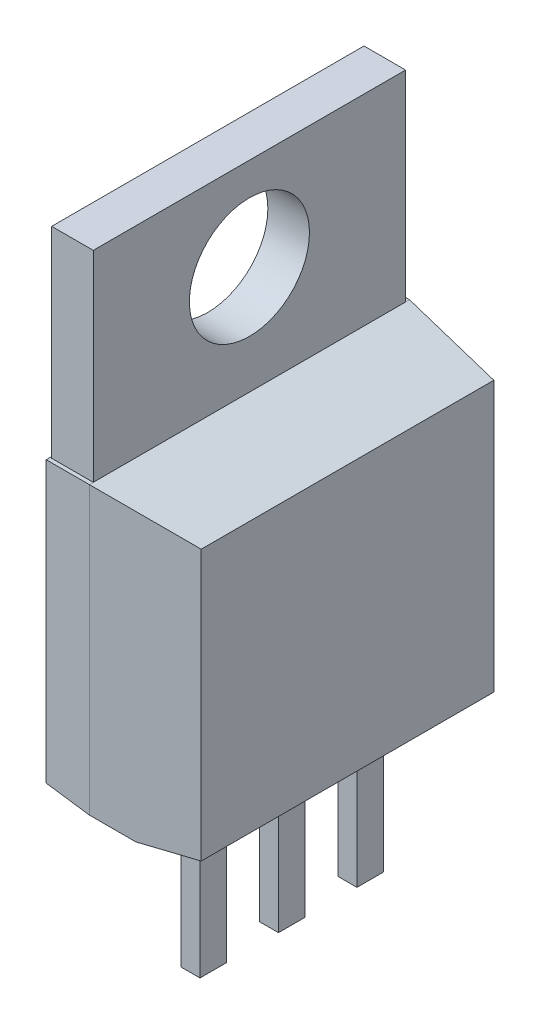
ISO-10303-21;
HEADER;
FILE_DESCRIPTION(('STEP AP214'),'2;1');
FILE_NAME('part.step','',(''),(''),'','','');
FILE_SCHEMA(('AUTOMOTIVE_DESIGN { 1 0 10303 214 1 1 1 1 }'));
ENDSEC;
DATA;
#1=APPLICATION_CONTEXT('core data for automotive mechanical design processes');
#2=APPLICATION_PROTOCOL_DEFINITION('international standard','automotive_design',2000,#1);
#3=PRODUCT_CONTEXT('',#1,'mechanical');
#4=PRODUCT('Part','Part','',(#3));
#5=PRODUCT_RELATED_PRODUCT_CATEGORY('part','',(#4));
#6=PRODUCT_DEFINITION_FORMATION('','',#4);
#7=PRODUCT_DEFINITION_CONTEXT('part definition',#1,'design');
#8=PRODUCT_DEFINITION('design','',#6,#7);
#9=PRODUCT_DEFINITION_SHAPE('','',#8);
#10=(LENGTH_UNIT() NAMED_UNIT(*) SI_UNIT(.MILLI.,.METRE.));
#11=(NAMED_UNIT(*) PLANE_ANGLE_UNIT() SI_UNIT($,.RADIAN.));
#12=(NAMED_UNIT(*) SI_UNIT($,.STERADIAN.) SOLID_ANGLE_UNIT());
#13=UNCERTAINTY_MEASURE_WITH_UNIT(LENGTH_MEASURE(1.E-05),#10,'distance_accuracy_value','');
#14=(GEOMETRIC_REPRESENTATION_CONTEXT(3) GLOBAL_UNCERTAINTY_ASSIGNED_CONTEXT((#13)) GLOBAL_UNIT_ASSIGNED_CONTEXT((#10,
#11,#12)) REPRESENTATION_CONTEXT('',''));
#15=CARTESIAN_POINT('',(0.,0.,0.));
#16=DIRECTION('',(0.,0.,1.));
#17=DIRECTION('',(1.,0.,0.));
#18=AXIS2_PLACEMENT_3D('',#15,#16,#17);
#19=CARTESIAN_POINT('',(-1.3208,0.,-5.1816));
#20=DIRECTION('',(-1.,0.,0.));
#21=DIRECTION('',(0.,0.,1.));
#22=AXIS2_PLACEMENT_3D('',#19,#20,#21);
#23=PLANE('',#22);
#24=DIRECTION('',(0.,0.,1.));
#25=VECTOR('',#24,1.);
#26=CARTESIAN_POINT('',(-1.3208,9.4488,-9.525));
#27=LINE('',#26,#25);
#28=CARTESIAN_POINT('',(-1.3208,9.4488,5.0546));
#29=VERTEX_POINT('',#28);
#30=CARTESIAN_POINT('',(-1.3208,9.4488,-5.0546));
#31=VERTEX_POINT('',#30);
#32=EDGE_CURVE('E301',#29,#31,#27,.F.);
#33=ORIENTED_EDGE('',*,*,#32,.T.);
#34=DIRECTION('',(0.,1.,0.));
#35=VECTOR('',#34,1.);
#36=CARTESIAN_POINT('',(-1.3208,16.5411947969702,-5.0546));
#37=LINE('',#36,#35);
#38=CARTESIAN_POINT('',(-1.3208,15.9512,-5.0546));
#39=VERTEX_POINT('',#38);
#40=EDGE_CURVE('E317',#31,#39,#37,.T.);
#41=ORIENTED_EDGE('',*,*,#40,.T.);
#42=DIRECTION('',(0.,0.,1.));
#43=VECTOR('',#42,1.);
#44=CARTESIAN_POINT('',(-1.3208,15.9512,5.1816));
#45=LINE('',#44,#43);
#46=CARTESIAN_POINT('',(-1.3208,15.9512,5.0546));
#47=VERTEX_POINT('',#46);
#48=EDGE_CURVE('E311',#47,#39,#45,.F.);
#49=ORIENTED_EDGE('',*,*,#48,.F.);
#50=DIRECTION('',(0.,1.,0.));
#51=VECTOR('',#50,1.);
#52=CARTESIAN_POINT('',(-1.3208,9.4488,5.0546));
#53=LINE('',#52,#51);
#54=EDGE_CURVE('E304',#47,#29,#53,.F.);
#55=ORIENTED_EDGE('',*,*,#54,.T.);
#56=EDGE_LOOP('',(#33,#41,#49,#55));
#57=FACE_BOUND('',#56,.T.);
#58=CARTESIAN_POINT('',(-1.3208,12.954,0.));
#59=DIRECTION('',(1.,0.,0.));
#60=DIRECTION('',(0.,0.,-1.));
#61=AXIS2_PLACEMENT_3D('',#58,#59,#60);
#62=CIRCLE('',#61,1.9431);
#63=CARTESIAN_POINT('',(-1.3208,12.954,-1.9431));
#64=VERTEX_POINT('',#63);
#65=EDGE_CURVE('E19',#64,#64,#62,.F.);
#66=ORIENTED_EDGE('',*,*,#65,.T.);
#67=EDGE_LOOP('',(#66));
#68=FACE_BOUND('',#67,.T.);
#69=ADVANCED_FACE('F16',(#57,#68),#23,.F.);
#70=CARTESIAN_POINT('',(0.0508,4.9022,-2.9718));
#71=DIRECTION('',(0.,0.,-1.));
#72=DIRECTION('',(-1.,0.,0.));
#73=AXIS2_PLACEMENT_3D('',#70,#71,#72);
#74=PLANE('',#73);
#75=DIRECTION('',(0.,1.,0.));
#76=VECTOR('',#75,1.);
#77=CARTESIAN_POINT('',(0.0508,4.9022,-2.9718));
#78=LINE('',#77,#76);
#79=CARTESIAN_POINT('',(0.0508,-4.8006,-2.9718));
#80=VERTEX_POINT('',#79);
#81=CARTESIAN_POINT('',(0.0507999999999999,0.00713947440288239,-2.9718));
#82=VERTEX_POINT('',#81);
#83=EDGE_CURVE('E287',#80,#82,#78,.T.);
#84=ORIENTED_EDGE('',*,*,#83,.F.);
#85=DIRECTION('',(1.,0.,0.));
#86=VECTOR('',#85,1.);
#87=CARTESIAN_POINT('',(0.,-4.8006,-2.9718));
#88=LINE('',#87,#86);
#89=CARTESIAN_POINT('',(-0.5588,-4.8006,-2.9718));
#90=VERTEX_POINT('',#89);
#91=EDGE_CURVE('E289',#80,#90,#88,.F.);
#92=ORIENTED_EDGE('',*,*,#91,.T.);
#93=DIRECTION('',(0.,1.,0.));
#94=VECTOR('',#93,1.);
#95=CARTESIAN_POINT('',(-0.5588,4.9022,-2.9718));
#96=LINE('',#95,#94);
#97=CARTESIAN_POINT('',(-0.5588,0.0785342184317104,-2.9718));
#98=VERTEX_POINT('',#97);
#99=EDGE_CURVE('E214',#98,#90,#96,.F.);
#100=ORIENTED_EDGE('',*,*,#99,.F.);
#101=DIRECTION('',(0.990268068741568,-0.139173100960085,0.));
#102=VECTOR('',#101,1.);
#103=CARTESIAN_POINT('',(-0.5588,0.0785342184317075,-2.9718));
#104=LINE('',#103,#102);
#105=CARTESIAN_POINT('',(0.,0.,-2.9718));
#106=VERTEX_POINT('',#105);
#107=EDGE_CURVE('E203',#98,#106,#104,.T.);
#108=ORIENTED_EDGE('',*,*,#107,.T.);
#109=DIRECTION('',(0.990268068741569,0.139173100960077,0.));
#110=VECTOR('',#109,1.);
#111=CARTESIAN_POINT('',(0.,0.,-2.9718));
#112=LINE('',#111,#110);
#113=EDGE_CURVE('E192',#106,#82,#112,.T.);
#114=ORIENTED_EDGE('',*,*,#113,.T.);
#115=EDGE_LOOP('',(#84,#92,#100,#108,#114));
#116=FACE_BOUND('',#115,.T.);
#117=ADVANCED_FACE('F212',(#116),#74,.T.);
#118=CARTESIAN_POINT('',(0.0508,4.9022,0.4318));
#119=DIRECTION('',(1.,0.,0.));
#120=DIRECTION('',(0.,0.,-1.));
#121=AXIS2_PLACEMENT_3D('',#118,#119,#120);
#122=PLANE('',#121);
#123=DIRECTION('',(0.,1.,0.));
#124=VECTOR('',#123,1.);
#125=CARTESIAN_POINT('',(0.0508,4.9022,0.4318));
#126=LINE('',#125,#124);
#127=CARTESIAN_POINT('',(0.0508,-4.8006,0.4318));
#128=VERTEX_POINT('',#127);
#129=CARTESIAN_POINT('',(0.0507999999999999,0.00713947440288261,0.4318));
#130=VERTEX_POINT('',#129);
#131=EDGE_CURVE('E275',#128,#130,#126,.T.);
#132=ORIENTED_EDGE('',*,*,#131,.F.);
#133=DIRECTION('',(0.,0.,-1.));
#134=VECTOR('',#133,1.);
#135=CARTESIAN_POINT('',(0.0508,-4.8006,0.4318));
#136=LINE('',#135,#134);
#137=CARTESIAN_POINT('',(0.0508,-4.8006,-0.4318));
#138=VERTEX_POINT('',#137);
#139=EDGE_CURVE('E325',#128,#138,#136,.T.);
#140=ORIENTED_EDGE('',*,*,#139,.T.);
#141=DIRECTION('',(0.,1.,0.));
#142=VECTOR('',#141,1.);
#143=CARTESIAN_POINT('',(0.0507999999999999,4.9022,-0.4318));
#144=LINE('',#143,#142);
#145=CARTESIAN_POINT('',(0.0507999999999999,0.0071394744028826,-0.4318));
#146=VERTEX_POINT('',#145);
#147=EDGE_CURVE('E266',#146,#138,#144,.F.);
#148=ORIENTED_EDGE('',*,*,#147,.F.);
#149=DIRECTION('',(0.,0.,-1.));
#150=VECTOR('',#149,1.);
#151=CARTESIAN_POINT('',(0.0508,0.00713947440288219,0.4318));
#152=LINE('',#151,#150);
#153=EDGE_CURVE('E202',#146,#130,#152,.F.);
#154=ORIENTED_EDGE('',*,*,#153,.T.);
#155=EDGE_LOOP('',(#132,#140,#148,#154));
#156=FACE_BOUND('',#155,.T.);
#157=ADVANCED_FACE('F330',(#156),#122,.T.);
#158=CARTESIAN_POINT('',(0.0508,4.9022,2.9718));
#159=DIRECTION('',(1.,0.,0.));
#160=DIRECTION('',(0.,0.,-1.));
#161=AXIS2_PLACEMENT_3D('',#158,#159,#160);
#162=PLANE('',#161);
#163=DIRECTION('',(0.,1.,0.));
#164=VECTOR('',#163,1.);
#165=CARTESIAN_POINT('',(0.0508,4.9022,2.9718));
#166=LINE('',#165,#164);
#167=CARTESIAN_POINT('',(0.0508,-4.8006,2.9718));
#168=VERTEX_POINT('',#167);
#169=CARTESIAN_POINT('',(0.0507999999999999,0.00713947440288261,2.9718));
#170=VERTEX_POINT('',#169);
#171=EDGE_CURVE('E253',#168,#170,#166,.T.);
#172=ORIENTED_EDGE('',*,*,#171,.F.);
#173=DIRECTION('',(0.,0.,-1.));
#174=VECTOR('',#173,1.);
#175=CARTESIAN_POINT('',(0.0508,-4.8006,2.9718));
#176=LINE('',#175,#174);
#177=CARTESIAN_POINT('',(0.0508,-4.8006,2.1082));
#178=VERTEX_POINT('',#177);
#179=EDGE_CURVE('E320',#168,#178,#176,.T.);
#180=ORIENTED_EDGE('',*,*,#179,.T.);
#181=DIRECTION('',(0.,1.,0.));
#182=VECTOR('',#181,1.);
#183=CARTESIAN_POINT('',(0.0507999999999999,4.9022,2.1082));
#184=LINE('',#183,#182);
#185=CARTESIAN_POINT('',(0.0507999999999999,0.0071394744028826,2.1082));
#186=VERTEX_POINT('',#185);
#187=EDGE_CURVE('E244',#186,#178,#184,.F.);
#188=ORIENTED_EDGE('',*,*,#187,.F.);
#189=DIRECTION('',(0.,0.,-1.));
#190=VECTOR('',#189,1.);
#191=CARTESIAN_POINT('',(0.0508,0.00713947440288219,2.9718));
#192=LINE('',#191,#190);
#193=EDGE_CURVE('E322',#186,#170,#192,.F.);
#194=ORIENTED_EDGE('',*,*,#193,.T.);
#195=EDGE_LOOP('',(#172,#180,#188,#194));
#196=FACE_BOUND('',#195,.T.);
#197=ADVANCED_FACE('F554',(#196),#162,.T.);
#198=CARTESIAN_POINT('',(-1.3208,12.954,0.));
#199=DIRECTION('',(1.,0.,0.));
#200=DIRECTION('',(0.,0.,-1.));
#201=AXIS2_PLACEMENT_3D('',#198,#199,#200);
#202=CYLINDRICAL_SURFACE('',#201,1.9431);
#203=ORIENTED_EDGE('',*,*,#65,.F.);
#204=EDGE_LOOP('',(#203));
#205=FACE_BOUND('',#204,.T.);
#206=CARTESIAN_POINT('',(-2.667,12.954,0.));
#207=DIRECTION('',(1.,0.,0.));
#208=DIRECTION('',(0.,0.,-1.));
#209=AXIS2_PLACEMENT_3D('',#206,#207,#208);
#210=CIRCLE('',#209,1.9431);
#211=CARTESIAN_POINT('',(-2.667,12.954,-1.9431));
#212=VERTEX_POINT('',#211);
#213=EDGE_CURVE('E218',#212,#212,#210,.F.);
#214=ORIENTED_EDGE('',*,*,#213,.T.);
#215=EDGE_LOOP('',(#214));
#216=FACE_BOUND('',#215,.T.);
#217=ADVANCED_FACE('F550',(#205,#216),#202,.F.);
#218=CARTESIAN_POINT('',(-1.3208,16.5411947969702,-5.0546));
#219=DIRECTION('',(0.,0.,1.));
#220=DIRECTION('',(1.,0.,0.));
#221=AXIS2_PLACEMENT_3D('',#218,#219,#220);
#222=PLANE('',#221);
#223=DIRECTION('',(1.,0.,0.));
#224=VECTOR('',#223,1.);
#225=CARTESIAN_POINT('',(-1.3208,9.4488,-5.0546));
#226=LINE('',#225,#224);
#227=CARTESIAN_POINT('',(-2.667,9.4488,-5.0546));
#228=VERTEX_POINT('',#227);
#229=EDGE_CURVE('E186',#228,#31,#226,.T.);
#230=ORIENTED_EDGE('',*,*,#229,.F.);
#231=DIRECTION('',(0.,1.,0.));
#232=VECTOR('',#231,1.);
#233=CARTESIAN_POINT('',(-2.667,9.4488,-5.0546));
#234=LINE('',#233,#232);
#235=CARTESIAN_POINT('',(-2.667,15.9512,-5.0546));
#236=VERTEX_POINT('',#235);
#237=EDGE_CURVE('E220',#228,#236,#234,.T.);
#238=ORIENTED_EDGE('',*,*,#237,.T.);
#239=DIRECTION('',(1.,0.,0.));
#240=VECTOR('',#239,1.);
#241=CARTESIAN_POINT('',(-2.7178,15.9512,-5.0546));
#242=LINE('',#241,#240);
#243=EDGE_CURVE('E314',#39,#236,#242,.F.);
#244=ORIENTED_EDGE('',*,*,#243,.F.);
#245=ORIENTED_EDGE('',*,*,#40,.F.);
#246=EDGE_LOOP('',(#230,#238,#244,#245));
#247=FACE_BOUND('',#246,.T.);
#248=ADVANCED_FACE('F547',(#247),#222,.F.);
#249=CARTESIAN_POINT('',(-2.7178,15.9512,5.1816));
#250=DIRECTION('',(0.,1.,0.));
#251=DIRECTION('',(0.,0.,1.));
#252=AXIS2_PLACEMENT_3D('',#249,#250,#251);
#253=PLANE('',#252);
#254=DIRECTION('',(-1.,0.,0.));
#255=VECTOR('',#254,1.);
#256=CARTESIAN_POINT('',(-1.3208,15.9512,5.0546));
#257=LINE('',#256,#255);
#258=CARTESIAN_POINT('',(-2.667,15.9512,5.0546));
#259=VERTEX_POINT('',#258);
#260=EDGE_CURVE('E306',#259,#47,#257,.F.);
#261=ORIENTED_EDGE('',*,*,#260,.T.);
#262=ORIENTED_EDGE('',*,*,#48,.T.);
#263=ORIENTED_EDGE('',*,*,#243,.T.);
#264=DIRECTION('',(0.,0.,-1.));
#265=VECTOR('',#264,1.);
#266=CARTESIAN_POINT('',(-2.667,15.9512,-6.35));
#267=LINE('',#266,#265);
#268=EDGE_CURVE('E224',#236,#259,#267,.F.);
#269=ORIENTED_EDGE('',*,*,#268,.T.);
#270=EDGE_LOOP('',(#261,#262,#263,#269));
#271=FACE_BOUND('',#270,.T.);
#272=ADVANCED_FACE('F379',(#271),#253,.T.);
#273=CARTESIAN_POINT('',(-1.3208,9.4488,5.0546));
#274=DIRECTION('',(0.,0.,-1.));
#275=DIRECTION('',(-1.,0.,0.));
#276=AXIS2_PLACEMENT_3D('',#273,#274,#275);
#277=PLANE('',#276);
#278=ORIENTED_EDGE('',*,*,#260,.F.);
#279=DIRECTION('',(0.,1.,0.));
#280=VECTOR('',#279,1.);
#281=CARTESIAN_POINT('',(-2.667,9.4488,5.0546));
#282=LINE('',#281,#280);
#283=CARTESIAN_POINT('',(-2.667,9.4488,5.0546));
#284=VERTEX_POINT('',#283);
#285=EDGE_CURVE('E374',#259,#284,#282,.F.);
#286=ORIENTED_EDGE('',*,*,#285,.T.);
#287=DIRECTION('',(-1.,0.,0.));
#288=VECTOR('',#287,1.);
#289=CARTESIAN_POINT('',(-1.3208,9.4488,5.0546));
#290=LINE('',#289,#288);
#291=EDGE_CURVE('E309',#29,#284,#290,.T.);
#292=ORIENTED_EDGE('',*,*,#291,.F.);
#293=ORIENTED_EDGE('',*,*,#54,.F.);
#294=EDGE_LOOP('',(#278,#286,#292,#293));
#295=FACE_BOUND('',#294,.T.);
#296=ADVANCED_FACE('F386',(#295),#277,.F.);
#297=CARTESIAN_POINT('',(-1.3208,9.4488,-9.525));
#298=DIRECTION('',(-0.139173100960095,-0.990268068741566,0.));
#299=DIRECTION('',(0.990268068741566,-0.139173100960095,0.));
#300=AXIS2_PLACEMENT_3D('',#297,#298,#299);
#301=PLANE('',#300);
#302=DIRECTION('',(0.980814848463982,-0.137844537491648,-0.137844537491658));
#303=VECTOR('',#302,1.);
#304=CARTESIAN_POINT('',(-1.32080000000016,9.4488,5.18159999999889));
#305=LINE('',#304,#303);
#306=CARTESIAN_POINT('',(-1.32080000000006,9.4488,5.18159999999955));
#307=VERTEX_POINT('',#306);
#308=CARTESIAN_POINT('',(1.85419999999995,9.00258284981983,4.73538284981936));
#309=VERTEX_POINT('',#308);
#310=EDGE_CURVE('E231',#307,#309,#305,.T.);
#311=ORIENTED_EDGE('',*,*,#310,.T.);
#312=DIRECTION('',(0.,0.,-1.));
#313=VECTOR('',#312,1.);
#314=CARTESIAN_POINT('',(1.8542,9.00258284981985,-5.1816));
#315=LINE('',#314,#313);
#316=CARTESIAN_POINT('',(1.85419999999999,9.00258284981984,-4.73538284981984));
#317=VERTEX_POINT('',#316);
#318=EDGE_CURVE('E236',#317,#309,#315,.F.);
#319=ORIENTED_EDGE('',*,*,#318,.F.);
#320=DIRECTION('',(-0.980814848463982,0.137844537491648,-0.137844537491658));
#321=VECTOR('',#320,1.);
#322=CARTESIAN_POINT('',(1.85419999999999,9.00258284981985,-4.73538284981981));
#323=LINE('',#322,#321);
#324=CARTESIAN_POINT('',(-1.3208,9.4488,-5.1816));
#325=VERTEX_POINT('',#324);
#326=EDGE_CURVE('E368',#317,#325,#323,.T.);
#327=ORIENTED_EDGE('',*,*,#326,.T.);
#328=DIRECTION('',(0.,0.,1.));
#329=VECTOR('',#328,1.);
#330=CARTESIAN_POINT('',(-1.3208,9.4488,-9.525));
#331=LINE('',#330,#329);
#332=EDGE_CURVE('E299',#31,#325,#331,.F.);
#333=ORIENTED_EDGE('',*,*,#332,.F.);
#334=ORIENTED_EDGE('',*,*,#32,.F.);
#335=DIRECTION('',(0.,0.,1.));
#336=VECTOR('',#335,1.);
#337=CARTESIAN_POINT('',(-1.32080000000004,9.44880000000001,-9.525));
#338=LINE('',#337,#336);
#339=EDGE_CURVE('E296',#307,#29,#338,.F.);
#340=ORIENTED_EDGE('',*,*,#339,.F.);
#341=EDGE_LOOP('',(#311,#319,#327,#333,#334,#340));
#342=FACE_BOUND('',#341,.T.);
#343=ADVANCED_FACE('F465',(#342),#301,.F.);
#344=CARTESIAN_POINT('',(-0.5588,4.9022,-2.9718));
#345=DIRECTION('',(-1.,0.,0.));
#346=DIRECTION('',(0.,0.,1.));
#347=AXIS2_PLACEMENT_3D('',#344,#345,#346);
#348=PLANE('',#347);
#349=ORIENTED_EDGE('',*,*,#99,.T.);
#350=DIRECTION('',(0.,0.,1.));
#351=VECTOR('',#350,1.);
#352=CARTESIAN_POINT('',(-0.5588,-4.8006,0.));
#353=LINE('',#352,#351);
#354=CARTESIAN_POINT('',(-0.5588,-4.8006,-2.1082));
#355=VERTEX_POINT('',#354);
#356=EDGE_CURVE('E291',#90,#355,#353,.T.);
#357=ORIENTED_EDGE('',*,*,#356,.T.);
#358=DIRECTION('',(0.,1.,0.));
#359=VECTOR('',#358,1.);
#360=CARTESIAN_POINT('',(-0.5588,4.9022,-2.1082));
#361=LINE('',#360,#359);
#362=CARTESIAN_POINT('',(-0.5588,0.078534218431709,-2.1082));
#363=VERTEX_POINT('',#362);
#364=EDGE_CURVE('E364',#363,#355,#361,.F.);
#365=ORIENTED_EDGE('',*,*,#364,.F.);
#366=DIRECTION('',(0.,0.,1.));
#367=VECTOR('',#366,1.);
#368=CARTESIAN_POINT('',(-0.5588,0.0785342184317075,-2.9718));
#369=LINE('',#368,#367);
#370=EDGE_CURVE('E294',#363,#98,#369,.F.);
#371=ORIENTED_EDGE('',*,*,#370,.T.);
#372=EDGE_LOOP('',(#349,#357,#365,#371));
#373=FACE_BOUND('',#372,.T.);
#374=ADVANCED_FACE('F536',(#373),#348,.T.);
#375=CARTESIAN_POINT('',(0.,-4.8006,0.));
#376=DIRECTION('',(0.,1.,0.));
#377=DIRECTION('',(0.,0.,1.));
#378=AXIS2_PLACEMENT_3D('',#375,#376,#377);
#379=PLANE('',#378);
#380=DIRECTION('',(0.,0.,-1.));
#381=VECTOR('',#380,1.);
#382=CARTESIAN_POINT('',(0.0508,-4.8006,-2.1082));
#383=LINE('',#382,#381);
#384=CARTESIAN_POINT('',(0.0508,-4.8006,-2.1082));
#385=VERTEX_POINT('',#384);
#386=EDGE_CURVE('E283',#385,#80,#383,.T.);
#387=ORIENTED_EDGE('',*,*,#386,.F.);
#388=DIRECTION('',(1.,0.,0.));
#389=VECTOR('',#388,1.);
#390=CARTESIAN_POINT('',(-0.5588,-4.8006,-2.1082));
#391=LINE('',#390,#389);
#392=EDGE_CURVE('E361',#355,#385,#391,.T.);
#393=ORIENTED_EDGE('',*,*,#392,.F.);
#394=ORIENTED_EDGE('',*,*,#356,.F.);
#395=ORIENTED_EDGE('',*,*,#91,.F.);
#396=EDGE_LOOP('',(#387,#393,#394,#395));
#397=FACE_BOUND('',#396,.T.);
#398=ADVANCED_FACE('F532',(#397),#379,.F.);
#399=CARTESIAN_POINT('',(0.0508,4.9022,-2.1082));
#400=DIRECTION('',(1.,0.,0.));
#401=DIRECTION('',(0.,0.,-1.));
#402=AXIS2_PLACEMENT_3D('',#399,#400,#401);
#403=PLANE('',#402);
#404=DIRECTION('',(0.,1.,0.));
#405=VECTOR('',#404,1.);
#406=CARTESIAN_POINT('',(0.0508,4.9022,-2.1082));
#407=LINE('',#406,#405);
#408=CARTESIAN_POINT('',(0.0508,0.0071394744028824,-2.1082));
#409=VERTEX_POINT('',#408);
#410=EDGE_CURVE('E358',#385,#409,#407,.T.);
#411=ORIENTED_EDGE('',*,*,#410,.F.);
#412=ORIENTED_EDGE('',*,*,#386,.T.);
#413=ORIENTED_EDGE('',*,*,#83,.T.);
#414=DIRECTION('',(0.,0.,-1.));
#415=VECTOR('',#414,1.);
#416=CARTESIAN_POINT('',(0.0508,0.00713947440288219,-2.1082));
#417=LINE('',#416,#415);
#418=EDGE_CURVE('E198',#82,#409,#417,.F.);
#419=ORIENTED_EDGE('',*,*,#418,.T.);
#420=EDGE_LOOP('',(#411,#412,#413,#419));
#421=FACE_BOUND('',#420,.T.);
#422=ADVANCED_FACE('F529',(#421),#403,.T.);
#423=CARTESIAN_POINT('',(-0.5588,4.9022,0.4318));
#424=DIRECTION('',(0.,0.,1.));
#425=DIRECTION('',(1.,0.,0.));
#426=AXIS2_PLACEMENT_3D('',#423,#424,#425);
#427=PLANE('',#426);
#428=DIRECTION('',(1.,0.,0.));
#429=VECTOR('',#428,1.);
#430=CARTESIAN_POINT('',(0.,-4.8006,0.4318));
#431=LINE('',#430,#429);
#432=CARTESIAN_POINT('',(-0.5588,-4.8006,0.4318));
#433=VERTEX_POINT('',#432);
#434=EDGE_CURVE('E261',#433,#128,#431,.T.);
#435=ORIENTED_EDGE('',*,*,#434,.T.);
#436=ORIENTED_EDGE('',*,*,#131,.T.);
#437=DIRECTION('',(-0.990268068741568,-0.139173100960079,0.));
#438=VECTOR('',#437,1.);
#439=CARTESIAN_POINT('',(0.0507999999999999,0.00713947440288219,0.4318));
#440=LINE('',#439,#438);
#441=CARTESIAN_POINT('',(0.,0.,0.4318));
#442=VERTEX_POINT('',#441);
#443=EDGE_CURVE('E280',#130,#442,#440,.T.);
#444=ORIENTED_EDGE('',*,*,#443,.T.);
#445=DIRECTION('',(-0.990268068741568,0.139173100960085,0.));
#446=VECTOR('',#445,1.);
#447=CARTESIAN_POINT('',(0.,0.,0.4318));
#448=LINE('',#447,#446);
#449=CARTESIAN_POINT('',(-0.5588,0.078534218431709,0.4318));
#450=VERTEX_POINT('',#449);
#451=EDGE_CURVE('E278',#442,#450,#448,.T.);
#452=ORIENTED_EDGE('',*,*,#451,.T.);
#453=DIRECTION('',(0.,1.,0.));
#454=VECTOR('',#453,1.);
#455=CARTESIAN_POINT('',(-0.5588,4.9022,0.4318));
#456=LINE('',#455,#454);
#457=EDGE_CURVE('E335',#433,#450,#456,.T.);
#458=ORIENTED_EDGE('',*,*,#457,.F.);
#459=EDGE_LOOP('',(#435,#436,#444,#452,#458));
#460=FACE_BOUND('',#459,.T.);
#461=ADVANCED_FACE('F332',(#460),#427,.T.);
#462=CARTESIAN_POINT('',(0.0508,4.9022,-0.4318));
#463=DIRECTION('',(0.,0.,-1.));
#464=DIRECTION('',(-1.,0.,0.));
#465=AXIS2_PLACEMENT_3D('',#462,#463,#464);
#466=PLANE('',#465);
#467=ORIENTED_EDGE('',*,*,#147,.T.);
#468=DIRECTION('',(1.,0.,0.));
#469=VECTOR('',#468,1.);
#470=CARTESIAN_POINT('',(0.,-4.8006,-0.4318));
#471=LINE('',#470,#469);
#472=CARTESIAN_POINT('',(-0.5588,-4.8006,-0.4318));
#473=VERTEX_POINT('',#472);
#474=EDGE_CURVE('E264',#138,#473,#471,.F.);
#475=ORIENTED_EDGE('',*,*,#474,.T.);
#476=DIRECTION('',(0.,1.,0.));
#477=VECTOR('',#476,1.);
#478=CARTESIAN_POINT('',(-0.5588,4.9022,-0.4318));
#479=LINE('',#478,#477);
#480=CARTESIAN_POINT('',(-0.5588,0.078534218431709,-0.4318));
#481=VERTEX_POINT('',#480);
#482=EDGE_CURVE('E348',#481,#473,#479,.F.);
#483=ORIENTED_EDGE('',*,*,#482,.F.);
#484=DIRECTION('',(0.990268068741568,-0.139173100960085,0.));
#485=VECTOR('',#484,1.);
#486=CARTESIAN_POINT('',(-0.5588,0.0785342184317075,-0.4318));
#487=LINE('',#486,#485);
#488=CARTESIAN_POINT('',(0.,0.,-0.4318));
#489=VERTEX_POINT('',#488);
#490=EDGE_CURVE('E272',#481,#489,#487,.T.);
#491=ORIENTED_EDGE('',*,*,#490,.T.);
#492=DIRECTION('',(0.990268068741569,0.139173100960077,0.));
#493=VECTOR('',#492,1.);
#494=CARTESIAN_POINT('',(0.,0.,-0.4318));
#495=LINE('',#494,#493);
#496=EDGE_CURVE('E269',#489,#146,#495,.T.);
#497=ORIENTED_EDGE('',*,*,#496,.T.);
#498=EDGE_LOOP('',(#467,#475,#483,#491,#497));
#499=FACE_BOUND('',#498,.T.);
#500=ADVANCED_FACE('F523',(#499),#466,.T.);
#501=CARTESIAN_POINT('',(0.,-4.8006,0.));
#502=DIRECTION('',(0.,1.,0.));
#503=DIRECTION('',(0.,0.,1.));
#504=AXIS2_PLACEMENT_3D('',#501,#502,#503);
#505=PLANE('',#504);
#506=ORIENTED_EDGE('',*,*,#434,.F.);
#507=DIRECTION('',(0.,0.,1.));
#508=VECTOR('',#507,1.);
#509=CARTESIAN_POINT('',(-0.5588,-4.8006,-0.4318));
#510=LINE('',#509,#508);
#511=EDGE_CURVE('E341',#473,#433,#510,.T.);
#512=ORIENTED_EDGE('',*,*,#511,.F.);
#513=ORIENTED_EDGE('',*,*,#474,.F.);
#514=ORIENTED_EDGE('',*,*,#139,.F.);
#515=EDGE_LOOP('',(#506,#512,#513,#514));
#516=FACE_BOUND('',#515,.T.);
#517=ADVANCED_FACE('F339',(#516),#505,.F.);
#518=CARTESIAN_POINT('',(-0.5588,4.9022,2.9718));
#519=DIRECTION('',(0.,0.,1.));
#520=DIRECTION('',(1.,0.,0.));
#521=AXIS2_PLACEMENT_3D('',#518,#519,#520);
#522=PLANE('',#521);
#523=DIRECTION('',(1.,0.,0.));
#524=VECTOR('',#523,1.);
#525=CARTESIAN_POINT('',(0.,-4.8006,2.9718));
#526=LINE('',#525,#524);
#527=CARTESIAN_POINT('',(-0.5588,-4.8006,2.9718));
#528=VERTEX_POINT('',#527);
#529=EDGE_CURVE('E239',#528,#168,#526,.T.);
#530=ORIENTED_EDGE('',*,*,#529,.T.);
#531=ORIENTED_EDGE('',*,*,#171,.T.);
#532=DIRECTION('',(-0.990268068741568,-0.139173100960079,0.));
#533=VECTOR('',#532,1.);
#534=CARTESIAN_POINT('',(0.0507999999999999,0.00713947440288219,2.9718));
#535=LINE('',#534,#533);
#536=CARTESIAN_POINT('',(0.,0.,2.9718));
#537=VERTEX_POINT('',#536);
#538=EDGE_CURVE('E258',#170,#537,#535,.T.);
#539=ORIENTED_EDGE('',*,*,#538,.T.);
#540=DIRECTION('',(-0.990268068741568,0.139173100960085,0.));
#541=VECTOR('',#540,1.);
#542=CARTESIAN_POINT('',(0.,0.,2.9718));
#543=LINE('',#542,#541);
#544=CARTESIAN_POINT('',(-0.5588,0.078534218431709,2.9718));
#545=VERTEX_POINT('',#544);
#546=EDGE_CURVE('E256',#537,#545,#543,.T.);
#547=ORIENTED_EDGE('',*,*,#546,.T.);
#548=DIRECTION('',(0.,1.,0.));
#549=VECTOR('',#548,1.);
#550=CARTESIAN_POINT('',(-0.5588,4.9022,2.9718));
#551=LINE('',#550,#549);
#552=EDGE_CURVE('E349',#528,#545,#551,.T.);
#553=ORIENTED_EDGE('',*,*,#552,.F.);
#554=EDGE_LOOP('',(#530,#531,#539,#547,#553));
#555=FACE_BOUND('',#554,.T.);
#556=ADVANCED_FACE('F430',(#555),#522,.T.);
#557=CARTESIAN_POINT('',(0.0508,4.9022,2.1082));
#558=DIRECTION('',(0.,0.,-1.));
#559=DIRECTION('',(-1.,0.,0.));
#560=AXIS2_PLACEMENT_3D('',#557,#558,#559);
#561=PLANE('',#560);
#562=ORIENTED_EDGE('',*,*,#187,.T.);
#563=DIRECTION('',(1.,0.,0.));
#564=VECTOR('',#563,1.);
#565=CARTESIAN_POINT('',(0.,-4.8006,2.1082));
#566=LINE('',#565,#564);
#567=CARTESIAN_POINT('',(-0.5588,-4.8006,2.1082));
#568=VERTEX_POINT('',#567);
#569=EDGE_CURVE('E242',#178,#568,#566,.F.);
#570=ORIENTED_EDGE('',*,*,#569,.T.);
#571=DIRECTION('',(0.,1.,0.));
#572=VECTOR('',#571,1.);
#573=CARTESIAN_POINT('',(-0.5588,4.9022,2.1082));
#574=LINE('',#573,#572);
#575=CARTESIAN_POINT('',(-0.5588,0.078534218431709,2.1082));
#576=VERTEX_POINT('',#575);
#577=EDGE_CURVE('E352',#576,#568,#574,.F.);
#578=ORIENTED_EDGE('',*,*,#577,.F.);
#579=DIRECTION('',(0.990268068741568,-0.139173100960085,0.));
#580=VECTOR('',#579,1.);
#581=CARTESIAN_POINT('',(-0.5588,0.0785342184317075,2.1082));
#582=LINE('',#581,#580);
#583=CARTESIAN_POINT('',(0.,0.,2.1082));
#584=VERTEX_POINT('',#583);
#585=EDGE_CURVE('E250',#576,#584,#582,.T.);
#586=ORIENTED_EDGE('',*,*,#585,.T.);
#587=DIRECTION('',(0.990268068741569,0.139173100960077,0.));
#588=VECTOR('',#587,1.);
#589=CARTESIAN_POINT('',(0.,0.,2.1082));
#590=LINE('',#589,#588);
#591=EDGE_CURVE('E247',#584,#186,#590,.T.);
#592=ORIENTED_EDGE('',*,*,#591,.T.);
#593=EDGE_LOOP('',(#562,#570,#578,#586,#592));
#594=FACE_BOUND('',#593,.T.);
#595=ADVANCED_FACE('F422',(#594),#561,.T.);
#596=CARTESIAN_POINT('',(0.,-4.8006,0.));
#597=DIRECTION('',(0.,1.,0.));
#598=DIRECTION('',(0.,0.,1.));
#599=AXIS2_PLACEMENT_3D('',#596,#597,#598);
#600=PLANE('',#599);
#601=ORIENTED_EDGE('',*,*,#529,.F.);
#602=DIRECTION('',(0.,0.,1.));
#603=VECTOR('',#602,1.);
#604=CARTESIAN_POINT('',(-0.5588,-4.8006,2.1082));
#605=LINE('',#604,#603);
#606=EDGE_CURVE('E411',#568,#528,#605,.T.);
#607=ORIENTED_EDGE('',*,*,#606,.F.);
#608=ORIENTED_EDGE('',*,*,#569,.F.);
#609=ORIENTED_EDGE('',*,*,#179,.F.);
#610=EDGE_LOOP('',(#601,#607,#608,#609));
#611=FACE_BOUND('',#610,.T.);
#612=ADVANCED_FACE('F427',(#611),#600,.F.);
#613=CARTESIAN_POINT('',(1.8542,0.,-5.1816));
#614=DIRECTION('',(1.,0.,0.));
#615=DIRECTION('',(0.,0.,-1.));
#616=AXIS2_PLACEMENT_3D('',#613,#614,#615);
#617=PLANE('',#616);
#618=DIRECTION('',(0.,1.,0.));
#619=VECTOR('',#618,1.);
#620=CARTESIAN_POINT('',(1.85419999999983,9.4488,4.7353828498187));
#621=LINE('',#620,#619);
#622=CARTESIAN_POINT('',(1.85419999999995,0.260590815705132,4.73538284981936));
#623=VERTEX_POINT('',#622);
#624=EDGE_CURVE('E226',#309,#623,#621,.F.);
#625=ORIENTED_EDGE('',*,*,#624,.T.);
#626=DIRECTION('',(0.,0.,1.));
#627=VECTOR('',#626,1.);
#628=CARTESIAN_POINT('',(1.85419999999997,0.260590815705227,-5.1816));
#629=LINE('',#628,#627);
#630=CARTESIAN_POINT('',(1.85419999999999,0.260590815705132,-4.73538284981983));
#631=VERTEX_POINT('',#630);
#632=EDGE_CURVE('E404',#631,#623,#629,.T.);
#633=ORIENTED_EDGE('',*,*,#632,.F.);
#634=DIRECTION('',(0.,1.,0.));
#635=VECTOR('',#634,1.);
#636=CARTESIAN_POINT('',(1.85419999999998,9.4488,-4.73538284981981));
#637=LINE('',#636,#635);
#638=EDGE_CURVE('E371',#631,#317,#637,.T.);
#639=ORIENTED_EDGE('',*,*,#638,.T.);
#640=ORIENTED_EDGE('',*,*,#318,.T.);
#641=EDGE_LOOP('',(#625,#633,#639,#640));
#642=FACE_BOUND('',#641,.T.);
#643=ADVANCED_FACE('F470',(#642),#617,.T.);
#644=CARTESIAN_POINT('',(2.72034,9.4488,4.61365481124952));
#645=DIRECTION('',(-0.139173100960095,0.,-0.990268068741566));
#646=DIRECTION('',(-0.990268068741566,0.,0.139173100960095));
#647=AXIS2_PLACEMENT_3D('',#644,#645,#646);
#648=PLANE('',#647);
#649=DIRECTION('',(-0.980814848463949,-0.137844537491653,0.137844537491888));
#650=VECTOR('',#649,1.);
#651=CARTESIAN_POINT('',(1.85419999999994,0.260590815705222,4.73538284981958));
#652=LINE('',#651,#650);
#653=CARTESIAN_POINT('',(-1.38227031252273E-13,0.,4.9959736655246));
#654=VERTEX_POINT('',#653);
#655=EDGE_CURVE('E398',#623,#654,#652,.T.);
#656=ORIENTED_EDGE('',*,*,#655,.F.);
#657=ORIENTED_EDGE('',*,*,#624,.F.);
#658=ORIENTED_EDGE('',*,*,#310,.F.);
#659=DIRECTION('',(0.,1.,0.));
#660=VECTOR('',#659,1.);
#661=CARTESIAN_POINT('',(-1.32080000000004,0.,5.1816));
#662=LINE('',#661,#660);
#663=CARTESIAN_POINT('',(-1.32080000000009,0.185626334474941,5.18159999999937));
#664=VERTEX_POINT('',#663);
#665=EDGE_CURVE('E393',#664,#307,#662,.T.);
#666=ORIENTED_EDGE('',*,*,#665,.F.);
#667=DIRECTION('',(-0.980814848463982,0.137844537491648,0.137844537491658));
#668=VECTOR('',#667,1.);
#669=CARTESIAN_POINT('',(-2.46330733588707E-13,0.,4.99597366552394));
#670=LINE('',#669,#668);
#671=EDGE_CURVE('E221',#654,#664,#670,.T.);
#672=ORIENTED_EDGE('',*,*,#671,.F.);
#673=EDGE_LOOP('',(#656,#657,#658,#666,#672));
#674=FACE_BOUND('',#673,.T.);
#675=ADVANCED_FACE('F473',(#674),#648,.F.);
#676=CARTESIAN_POINT('',(-2.667,9.4488,-6.35));
#677=DIRECTION('',(1.,0.,0.));
#678=DIRECTION('',(0.,0.,-1.));
#679=AXIS2_PLACEMENT_3D('',#676,#677,#678);
#680=PLANE('',#679);
#681=ORIENTED_EDGE('',*,*,#285,.F.);
#682=ORIENTED_EDGE('',*,*,#268,.F.);
#683=ORIENTED_EDGE('',*,*,#237,.F.);
#684=DIRECTION('',(0.,0.,-1.));
#685=VECTOR('',#684,1.);
#686=CARTESIAN_POINT('',(-2.667,9.4488,-5.0546));
#687=LINE('',#686,#685);
#688=EDGE_CURVE('E391',#228,#284,#687,.F.);
#689=ORIENTED_EDGE('',*,*,#688,.T.);
#690=EDGE_LOOP('',(#681,#682,#683,#689));
#691=FACE_BOUND('',#690,.T.);
#692=ORIENTED_EDGE('',*,*,#213,.F.);
#693=EDGE_LOOP('',(#692));
#694=FACE_BOUND('',#693,.T.);
#695=ADVANCED_FACE('F389',(#691,#694),#680,.F.);
#696=CARTESIAN_POINT('',(-1.3208,9.4488,-5.1816));
#697=DIRECTION('',(-0.139173100960095,0.,0.990268068741566));
#698=DIRECTION('',(0.990268068741566,0.,0.139173100960095));
#699=AXIS2_PLACEMENT_3D('',#696,#697,#698);
#700=PLANE('',#699);
#701=DIRECTION('',(0.980814848463983,-0.137844537491639,0.137844537491658));
#702=VECTOR('',#701,1.);
#703=CARTESIAN_POINT('',(-1.3208,0.185626334474921,-5.1816));
#704=LINE('',#703,#702);
#705=CARTESIAN_POINT('',(-1.3208,0.18562633447493,-5.1816));
#706=VERTEX_POINT('',#705);
#707=CARTESIAN_POINT('',(0.,0.,-4.99597366552521));
#708=VERTEX_POINT('',#707);
#709=EDGE_CURVE('E208',#706,#708,#704,.T.);
#710=ORIENTED_EDGE('',*,*,#709,.F.);
#711=DIRECTION('',(0.,1.,0.));
#712=VECTOR('',#711,1.);
#713=CARTESIAN_POINT('',(-1.3208,0.,-5.1816));
#714=LINE('',#713,#712);
#715=EDGE_CURVE('E395',#706,#325,#714,.T.);
#716=ORIENTED_EDGE('',*,*,#715,.T.);
#717=ORIENTED_EDGE('',*,*,#326,.F.);
#718=ORIENTED_EDGE('',*,*,#638,.F.);
#719=DIRECTION('',(0.980814848463959,0.137844537491655,0.137844537491813));
#720=VECTOR('',#719,1.);
#721=CARTESIAN_POINT('',(0.,0.,-4.99597366552538));
#722=LINE('',#721,#720);
#723=EDGE_CURVE('E407',#708,#631,#722,.T.);
#724=ORIENTED_EDGE('',*,*,#723,.F.);
#725=EDGE_LOOP('',(#710,#716,#717,#718,#724));
#726=FACE_BOUND('',#725,.T.);
#727=ADVANCED_FACE('F454',(#726),#700,.F.);
#728=CARTESIAN_POINT('',(-0.5588,4.9022,-2.1082));
#729=DIRECTION('',(0.,0.,1.));
#730=DIRECTION('',(1.,0.,0.));
#731=AXIS2_PLACEMENT_3D('',#728,#729,#730);
#732=PLANE('',#731);
#733=ORIENTED_EDGE('',*,*,#392,.T.);
#734=ORIENTED_EDGE('',*,*,#410,.T.);
#735=DIRECTION('',(0.990268068741566,0.139173100960095,0.));
#736=VECTOR('',#735,1.);
#737=CARTESIAN_POINT('',(0.,0.,-2.1082));
#738=LINE('',#737,#736);
#739=CARTESIAN_POINT('',(0.,0.,-2.1082));
#740=VERTEX_POINT('',#739);
#741=EDGE_CURVE('E409',#740,#409,#738,.T.);
#742=ORIENTED_EDGE('',*,*,#741,.F.);
#743=DIRECTION('',(0.990268068741566,-0.139173100960095,0.));
#744=VECTOR('',#743,1.);
#745=CARTESIAN_POINT('',(0.,0.,-2.1082));
#746=LINE('',#745,#744);
#747=EDGE_CURVE('E446',#363,#740,#746,.T.);
#748=ORIENTED_EDGE('',*,*,#747,.F.);
#749=ORIENTED_EDGE('',*,*,#364,.T.);
#750=EDGE_LOOP('',(#733,#734,#742,#748,#749));
#751=FACE_BOUND('',#750,.T.);
#752=ADVANCED_FACE('F503',(#751),#732,.T.);
#753=CARTESIAN_POINT('',(-0.5588,4.9022,-0.4318));
#754=DIRECTION('',(-1.,0.,0.));
#755=DIRECTION('',(0.,0.,1.));
#756=AXIS2_PLACEMENT_3D('',#753,#754,#755);
#757=PLANE('',#756);
#758=ORIENTED_EDGE('',*,*,#482,.T.);
#759=ORIENTED_EDGE('',*,*,#511,.T.);
#760=ORIENTED_EDGE('',*,*,#457,.T.);
#761=DIRECTION('',(0.,0.,1.));
#762=VECTOR('',#761,1.);
#763=CARTESIAN_POINT('',(-0.558799999999999,0.0785342184317133,-5.1816));
#764=LINE('',#763,#762);
#765=EDGE_CURVE('E438',#481,#450,#764,.T.);
#766=ORIENTED_EDGE('',*,*,#765,.F.);
#767=EDGE_LOOP('',(#758,#759,#760,#766));
#768=FACE_BOUND('',#767,.T.);
#769=ADVANCED_FACE('F344',(#768),#757,.T.);
#770=CARTESIAN_POINT('',(-0.5588,4.9022,2.1082));
#771=DIRECTION('',(-1.,0.,0.));
#772=DIRECTION('',(0.,0.,1.));
#773=AXIS2_PLACEMENT_3D('',#770,#771,#772);
#774=PLANE('',#773);
#775=ORIENTED_EDGE('',*,*,#577,.T.);
#776=ORIENTED_EDGE('',*,*,#606,.T.);
#777=ORIENTED_EDGE('',*,*,#552,.T.);
#778=DIRECTION('',(0.,0.,1.));
#779=VECTOR('',#778,1.);
#780=CARTESIAN_POINT('',(-0.558799999999999,0.0785342184317133,-5.1816));
#781=LINE('',#780,#779);
#782=EDGE_CURVE('E420',#576,#545,#781,.T.);
#783=ORIENTED_EDGE('',*,*,#782,.F.);
#784=EDGE_LOOP('',(#775,#776,#777,#783));
#785=FACE_BOUND('',#784,.T.);
#786=ADVANCED_FACE('F417',(#785),#774,.T.);
#787=CARTESIAN_POINT('',(0.,0.,-5.1816));
#788=DIRECTION('',(0.139173100960095,-0.990268068741566,0.));
#789=DIRECTION('',(0.990268068741566,0.139173100960095,0.));
#790=AXIS2_PLACEMENT_3D('',#787,#788,#789);
#791=PLANE('',#790);
#792=ORIENTED_EDGE('',*,*,#153,.F.);
#793=ORIENTED_EDGE('',*,*,#496,.F.);
#794=DIRECTION('',(0.,0.,1.));
#795=VECTOR('',#794,1.);
#796=CARTESIAN_POINT('',(0.,0.,-5.1816));
#797=LINE('',#796,#795);
#798=EDGE_CURVE('E443',#740,#489,#797,.T.);
#799=ORIENTED_EDGE('',*,*,#798,.F.);
#800=ORIENTED_EDGE('',*,*,#741,.T.);
#801=ORIENTED_EDGE('',*,*,#418,.F.);
#802=ORIENTED_EDGE('',*,*,#113,.F.);
#803=DIRECTION('',(0.,0.,1.));
#804=VECTOR('',#803,1.);
#805=CARTESIAN_POINT('',(0.,0.,-5.1816));
#806=LINE('',#805,#804);
#807=EDGE_CURVE('E196',#708,#106,#806,.T.);
#808=ORIENTED_EDGE('',*,*,#807,.F.);
#809=ORIENTED_EDGE('',*,*,#723,.T.);
#810=ORIENTED_EDGE('',*,*,#632,.T.);
#811=ORIENTED_EDGE('',*,*,#655,.T.);
#812=DIRECTION('',(0.,0.,1.));
#813=VECTOR('',#812,1.);
#814=CARTESIAN_POINT('',(0.,0.,-5.1816));
#815=LINE('',#814,#813);
#816=EDGE_CURVE('E433',#537,#654,#815,.T.);
#817=ORIENTED_EDGE('',*,*,#816,.F.);
#818=ORIENTED_EDGE('',*,*,#538,.F.);
#819=ORIENTED_EDGE('',*,*,#193,.F.);
#820=ORIENTED_EDGE('',*,*,#591,.F.);
#821=DIRECTION('',(0.,0.,1.));
#822=VECTOR('',#821,1.);
#823=CARTESIAN_POINT('',(0.,0.,-5.1816));
#824=LINE('',#823,#822);
#825=EDGE_CURVE('E434',#442,#584,#824,.T.);
#826=ORIENTED_EDGE('',*,*,#825,.F.);
#827=ORIENTED_EDGE('',*,*,#443,.F.);
#828=EDGE_LOOP('',(#792,#793,#799,#800,#801,#802,#808,#809,#810,#811,#817,#818,#819,#820,#826,#827));
#829=FACE_BOUND('',#828,.T.);
#830=ADVANCED_FACE('F194',(#829),#791,.T.);
#831=CARTESIAN_POINT('',(0.,0.,5.1816));
#832=DIRECTION('',(0.,0.,1.));
#833=DIRECTION('',(1.,0.,0.));
#834=AXIS2_PLACEMENT_3D('',#831,#832,#833);
#835=PLANE('',#834);
#836=DIRECTION('',(0.,1.,0.));
#837=VECTOR('',#836,1.);
#838=CARTESIAN_POINT('',(-2.7178,9.4488,5.1816));
#839=LINE('',#838,#837);
#840=CARTESIAN_POINT('',(-2.7178,0.381961880554252,5.18159999999993));
#841=VERTEX_POINT('',#840);
#842=CARTESIAN_POINT('',(-2.7178,9.4488,5.18159999999993));
#843=VERTEX_POINT('',#842);
#844=EDGE_CURVE('E210',#841,#843,#839,.T.);
#845=ORIENTED_EDGE('',*,*,#844,.F.);
#846=DIRECTION('',(0.990268068741566,-0.139173100960095,0.));
#847=VECTOR('',#846,1.);
#848=CARTESIAN_POINT('',(0.,0.,5.18159999999972));
#849=LINE('',#848,#847);
#850=EDGE_CURVE('E436',#664,#841,#849,.F.);
#851=ORIENTED_EDGE('',*,*,#850,.F.);
#852=ORIENTED_EDGE('',*,*,#665,.T.);
#853=DIRECTION('',(1.,0.,0.));
#854=VECTOR('',#853,1.);
#855=CARTESIAN_POINT('',(-1.3208,9.4488,5.18159999999972));
#856=LINE('',#855,#854);
#857=EDGE_CURVE('E392',#307,#843,#856,.F.);
#858=ORIENTED_EDGE('',*,*,#857,.T.);
#859=EDGE_LOOP('',(#845,#851,#852,#858));
#860=FACE_BOUND('',#859,.T.);
#861=ADVANCED_FACE('F476',(#860),#835,.T.);
#862=CARTESIAN_POINT('',(-1.3208,9.4488,-5.0546));
#863=DIRECTION('',(0.,-1.,0.));
#864=DIRECTION('',(0.,0.,-1.));
#865=AXIS2_PLACEMENT_3D('',#862,#863,#864);
#866=PLANE('',#865);
#867=DIRECTION('',(1.,0.,0.));
#868=VECTOR('',#867,1.);
#869=CARTESIAN_POINT('',(0.,9.4488,-5.1816));
#870=LINE('',#869,#868);
#871=CARTESIAN_POINT('',(-2.7178,9.4488,-5.1816));
#872=VERTEX_POINT('',#871);
#873=EDGE_CURVE('E449',#325,#872,#870,.F.);
#874=ORIENTED_EDGE('',*,*,#873,.T.);
#875=DIRECTION('',(0.,0.,1.));
#876=VECTOR('',#875,1.);
#877=CARTESIAN_POINT('',(-2.7178,9.4488,-5.1816));
#878=LINE('',#877,#876);
#879=EDGE_CURVE('E461',#843,#872,#878,.F.);
#880=ORIENTED_EDGE('',*,*,#879,.F.);
#881=ORIENTED_EDGE('',*,*,#857,.F.);
#882=ORIENTED_EDGE('',*,*,#339,.T.);
#883=ORIENTED_EDGE('',*,*,#291,.T.);
#884=ORIENTED_EDGE('',*,*,#688,.F.);
#885=ORIENTED_EDGE('',*,*,#229,.T.);
#886=ORIENTED_EDGE('',*,*,#332,.T.);
#887=EDGE_LOOP('',(#874,#880,#881,#882,#883,#884,#885,#886));
#888=FACE_BOUND('',#887,.T.);
#889=ADVANCED_FACE('F459',(#888),#866,.F.);
#890=CARTESIAN_POINT('',(0.,0.,-5.1816));
#891=DIRECTION('',(0.,0.,1.));
#892=DIRECTION('',(1.,0.,0.));
#893=AXIS2_PLACEMENT_3D('',#890,#891,#892);
#894=PLANE('',#893);
#895=DIRECTION('',(0.,1.,0.));
#896=VECTOR('',#895,1.);
#897=CARTESIAN_POINT('',(-2.7178,9.4488,-5.1816));
#898=LINE('',#897,#896);
#899=CARTESIAN_POINT('',(-2.7178,0.381961880554255,-5.1816));
#900=VERTEX_POINT('',#899);
#901=EDGE_CURVE('E25',#872,#900,#898,.F.);
#902=ORIENTED_EDGE('',*,*,#901,.F.);
#903=ORIENTED_EDGE('',*,*,#873,.F.);
#904=ORIENTED_EDGE('',*,*,#715,.F.);
#905=DIRECTION('',(0.990268068741566,-0.139173100960095,0.));
#906=VECTOR('',#905,1.);
#907=CARTESIAN_POINT('',(0.,0.,-5.1816));
#908=LINE('',#907,#906);
#909=EDGE_CURVE('E34',#900,#706,#908,.T.);
#910=ORIENTED_EDGE('',*,*,#909,.F.);
#911=EDGE_LOOP('',(#902,#903,#904,#910));
#912=FACE_BOUND('',#911,.T.);
#913=ADVANCED_FACE('F455',(#912),#894,.F.);
#914=CARTESIAN_POINT('',(0.,0.,-5.1816));
#915=DIRECTION('',(-0.139173100960095,-0.990268068741566,0.));
#916=DIRECTION('',(0.990268068741566,-0.139173100960095,0.));
#917=AXIS2_PLACEMENT_3D('',#914,#915,#916);
#918=PLANE('',#917);
#919=ORIENTED_EDGE('',*,*,#807,.T.);
#920=ORIENTED_EDGE('',*,*,#107,.F.);
#921=ORIENTED_EDGE('',*,*,#370,.F.);
#922=ORIENTED_EDGE('',*,*,#747,.T.);
#923=ORIENTED_EDGE('',*,*,#798,.T.);
#924=ORIENTED_EDGE('',*,*,#490,.F.);
#925=ORIENTED_EDGE('',*,*,#765,.T.);
#926=ORIENTED_EDGE('',*,*,#451,.F.);
#927=ORIENTED_EDGE('',*,*,#825,.T.);
#928=ORIENTED_EDGE('',*,*,#585,.F.);
#929=ORIENTED_EDGE('',*,*,#782,.T.);
#930=ORIENTED_EDGE('',*,*,#546,.F.);
#931=ORIENTED_EDGE('',*,*,#816,.T.);
#932=ORIENTED_EDGE('',*,*,#671,.T.);
#933=ORIENTED_EDGE('',*,*,#850,.T.);
#934=DIRECTION('',(0.,0.,1.));
#935=VECTOR('',#934,1.);
#936=CARTESIAN_POINT('',(-2.7178,0.381961880554258,-5.1816));
#937=LINE('',#936,#935);
#938=EDGE_CURVE('E11',#900,#841,#937,.T.);
#939=ORIENTED_EDGE('',*,*,#938,.F.);
#940=ORIENTED_EDGE('',*,*,#909,.T.);
#941=ORIENTED_EDGE('',*,*,#709,.T.);
#942=EDGE_LOOP('',(#919,#920,#921,#922,#923,#924,#925,#926,#927,#928,#929,#930,#931,#932,#933,
#939,#940,#941));
#943=FACE_BOUND('',#942,.T.);
#944=ADVANCED_FACE('F206',(#943),#918,.T.);
#945=CARTESIAN_POINT('',(-2.7178,9.4488,-5.1816));
#946=DIRECTION('',(-1.,0.,0.));
#947=DIRECTION('',(0.,0.,1.));
#948=AXIS2_PLACEMENT_3D('',#945,#946,#947);
#949=PLANE('',#948);
#950=ORIENTED_EDGE('',*,*,#901,.T.);
#951=ORIENTED_EDGE('',*,*,#938,.T.);
#952=ORIENTED_EDGE('',*,*,#844,.T.);
#953=ORIENTED_EDGE('',*,*,#879,.T.);
#954=EDGE_LOOP('',(#950,#951,#952,#953));
#955=FACE_BOUND('',#954,.T.);
#956=ADVANCED_FACE('F482',(#955),#949,.T.);
#957=CLOSED_SHELL('',(#69,#117,#157,#197,#217,#248,#272,#296,#343,#374,#398,#422,#461,#500,#517,
#556,#595,#612,#643,#675,#695,#727,#752,#769,#786,#830,#861,#889,#913,#944,#956));
#958=MANIFOLD_SOLID_BREP('B1',#957);
#959=ADVANCED_BREP_SHAPE_REPRESENTATION('',(#18,#958),#14);
#960=SHAPE_DEFINITION_REPRESENTATION(#9,#959);
ENDSEC;
END-ISO-10303-21;
